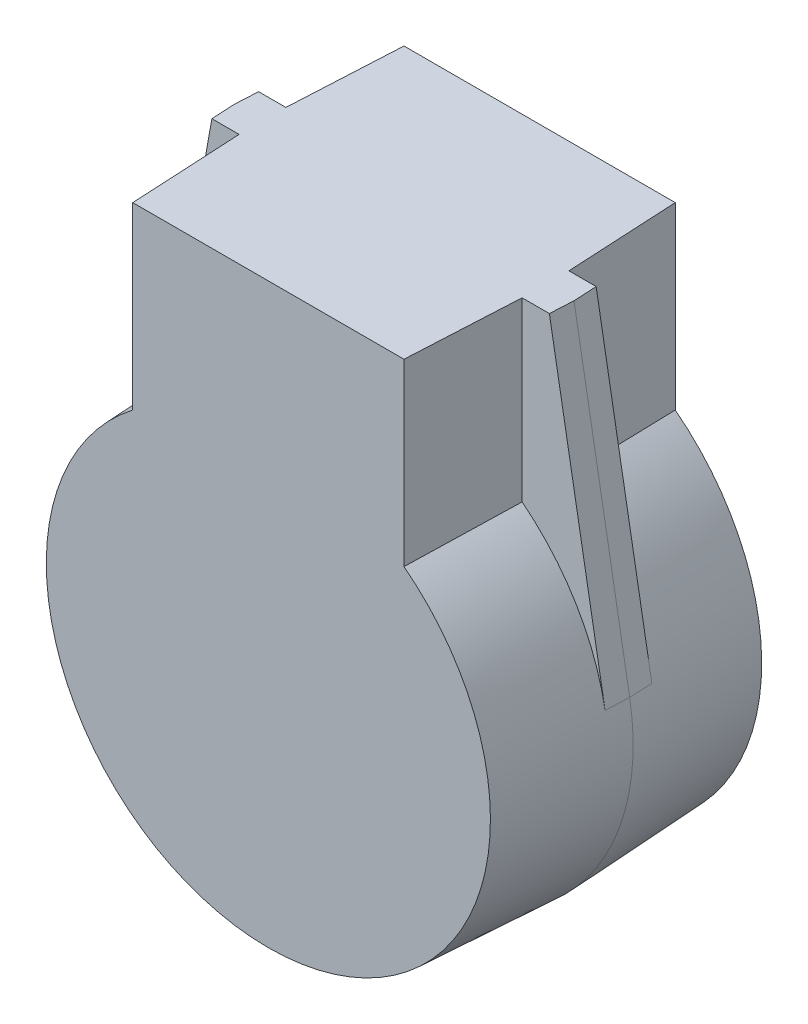
ISO-10303-21;
HEADER;
FILE_DESCRIPTION(('STEP AP214'),'2;1');
FILE_NAME('part.step','',(''),(''),'','','');
FILE_SCHEMA(('AUTOMOTIVE_DESIGN { 1 0 10303 214 1 1 1 1 }'));
ENDSEC;
DATA;
#1=APPLICATION_CONTEXT('core data for automotive mechanical design processes');
#2=APPLICATION_PROTOCOL_DEFINITION('international standard','automotive_design',2000,#1);
#3=PRODUCT_CONTEXT('',#1,'mechanical');
#4=PRODUCT('Part','Part','',(#3));
#5=PRODUCT_RELATED_PRODUCT_CATEGORY('part','',(#4));
#6=PRODUCT_DEFINITION_FORMATION('','',#4);
#7=PRODUCT_DEFINITION_CONTEXT('part definition',#1,'design');
#8=PRODUCT_DEFINITION('design','',#6,#7);
#9=PRODUCT_DEFINITION_SHAPE('','',#8);
#10=(LENGTH_UNIT() NAMED_UNIT(*) SI_UNIT(.MILLI.,.METRE.));
#11=(NAMED_UNIT(*) PLANE_ANGLE_UNIT() SI_UNIT($,.RADIAN.));
#12=(NAMED_UNIT(*) SI_UNIT($,.STERADIAN.) SOLID_ANGLE_UNIT());
#13=UNCERTAINTY_MEASURE_WITH_UNIT(LENGTH_MEASURE(1.E-05),#10,'distance_accuracy_value','');
#14=(GEOMETRIC_REPRESENTATION_CONTEXT(3) GLOBAL_UNCERTAINTY_ASSIGNED_CONTEXT((#13)) GLOBAL_UNIT_ASSIGNED_CONTEXT((#10,
#11,#12)) REPRESENTATION_CONTEXT('',''));
#15=CARTESIAN_POINT('',(0.,0.,0.));
#16=DIRECTION('',(0.,0.,1.));
#17=DIRECTION('',(1.,0.,0.));
#18=AXIS2_PLACEMENT_3D('',#15,#16,#17);
#19=CARTESIAN_POINT('',(-36.35,76.,-29.));
#20=DIRECTION('',(0.,-1.,0.));
#21=DIRECTION('',(1.,0.,0.));
#22=AXIS2_PLACEMENT_3D('',#19,#20,#21);
#23=PLANE('',#22);
#24=DIRECTION('',(-1.,0.,0.));
#25=VECTOR('',#24,1.);
#26=CARTESIAN_POINT('',(-36.35,76.,29.));
#27=LINE('',#26,#25);
#28=CARTESIAN_POINT('',(29.,76.,29.));
#29=VERTEX_POINT('',#28);
#30=CARTESIAN_POINT('',(-29.,76.,29.));
#31=VERTEX_POINT('',#30);
#32=EDGE_CURVE('E114',#29,#31,#27,.T.);
#33=ORIENTED_EDGE('',*,*,#32,.F.);
#34=DIRECTION('',(-0.0523359562429445,0.,0.998629534754574));
#35=VECTOR('',#34,1.);
#36=CARTESIAN_POINT('',(30.257786702793,76.,5.));
#37=LINE('',#36,#35);
#38=CARTESIAN_POINT('',(30.257786702793,76.,5.));
#39=VERTEX_POINT('',#38);
#40=EDGE_CURVE('E135',#39,#29,#37,.T.);
#41=ORIENTED_EDGE('',*,*,#40,.F.);
#42=DIRECTION('',(1.,0.,0.));
#43=VECTOR('',#42,1.);
#44=CARTESIAN_POINT('',(-36.35,76.,5.));
#45=LINE('',#44,#43);
#46=CARTESIAN_POINT('',(36.0839153234149,76.,5.));
#47=VERTEX_POINT('',#46);
#48=EDGE_CURVE('E286',#39,#47,#45,.T.);
#49=ORIENTED_EDGE('',*,*,#48,.T.);
#50=DIRECTION('',(-0.0531417386978423,0.,0.998586979490605));
#51=VECTOR('',#50,1.);
#52=CARTESIAN_POINT('',(37.6836247743269,76.,-25.0601573789613));
#53=LINE('',#52,#51);
#54=CARTESIAN_POINT('',(36.3500000000031,76.,1.17569148860852E-10));
#55=VERTEX_POINT('',#54);
#56=EDGE_CURVE('E249',#55,#47,#53,.T.);
#57=ORIENTED_EDGE('',*,*,#56,.F.);
#58=DIRECTION('',(-0.0531417386974387,0.,-0.998586979490627));
#59=VECTOR('',#58,1.);
#60=CARTESIAN_POINT('',(34.6057591711221,76.,-32.776048046284));
#61=LINE('',#60,#59);
#62=CARTESIAN_POINT('',(36.0839153234044,76.,-5.));
#63=VERTEX_POINT('',#62);
#64=EDGE_CURVE('E248',#55,#63,#61,.T.);
#65=ORIENTED_EDGE('',*,*,#64,.T.);
#66=DIRECTION('',(-1.,0.,0.));
#67=VECTOR('',#66,1.);
#68=CARTESIAN_POINT('',(-36.35,76.,-5.));
#69=LINE('',#68,#67);
#70=CARTESIAN_POINT('',(30.257786702793,76.,-5.));
#71=VERTEX_POINT('',#70);
#72=EDGE_CURVE('E274',#63,#71,#69,.T.);
#73=ORIENTED_EDGE('',*,*,#72,.T.);
#74=DIRECTION('',(0.0523359562429445,0.,0.998629534754574));
#75=VECTOR('',#74,1.);
#76=CARTESIAN_POINT('',(30.257786702793,76.,-5.));
#77=LINE('',#76,#75);
#78=CARTESIAN_POINT('',(29.,76.,-29.));
#79=VERTEX_POINT('',#78);
#80=EDGE_CURVE('E271',#79,#71,#77,.T.);
#81=ORIENTED_EDGE('',*,*,#80,.F.);
#82=DIRECTION('',(1.,0.,0.));
#83=VECTOR('',#82,1.);
#84=CARTESIAN_POINT('',(29.,76.,-29.));
#85=LINE('',#84,#83);
#86=CARTESIAN_POINT('',(-29.,76.,-29.));
#87=VERTEX_POINT('',#86);
#88=EDGE_CURVE('E321',#87,#79,#85,.T.);
#89=ORIENTED_EDGE('',*,*,#88,.F.);
#90=DIRECTION('',(0.0523359562429446,0.,-0.998629534754574));
#91=VECTOR('',#90,1.);
#92=CARTESIAN_POINT('',(-29.,76.,-29.));
#93=LINE('',#92,#91);
#94=CARTESIAN_POINT('',(-30.257786702793,76.,-5.));
#95=VERTEX_POINT('',#94);
#96=EDGE_CURVE('E317',#95,#87,#93,.T.);
#97=ORIENTED_EDGE('',*,*,#96,.F.);
#98=CARTESIAN_POINT('',(-36.083915323408,76.,-5.));
#99=VERTEX_POINT('',#98);
#100=EDGE_CURVE('E277',#95,#99,#69,.T.);
#101=ORIENTED_EDGE('',*,*,#100,.T.);
#102=DIRECTION('',(0.0531417386975882,0.,-0.998586979490619));
#103=VECTOR('',#102,1.);
#104=CARTESIAN_POINT('',(-34.811067198405,76.,-28.9181027126378));
#105=LINE('',#104,#103);
#106=CARTESIAN_POINT('',(-36.3499999999989,76.,-4.44332071136699E-11));
#107=VERTEX_POINT('',#106);
#108=EDGE_CURVE('E293',#107,#99,#105,.T.);
#109=ORIENTED_EDGE('',*,*,#108,.F.);
#110=DIRECTION('',(0.053141738697429,0.,0.998586979490627));
#111=VECTOR('',#110,1.);
#112=CARTESIAN_POINT('',(-37.8889328015881,76.,-28.9181027126384));
#113=LINE('',#112,#111);
#114=CARTESIAN_POINT('',(-36.083915323404,76.,5.));
#115=VERTEX_POINT('',#114);
#116=EDGE_CURVE('E291',#107,#115,#113,.T.);
#117=ORIENTED_EDGE('',*,*,#116,.T.);
#118=CARTESIAN_POINT('',(-30.257786702793,76.,5.));
#119=VERTEX_POINT('',#118);
#120=EDGE_CURVE('E133',#115,#119,#45,.T.);
#121=ORIENTED_EDGE('',*,*,#120,.T.);
#122=DIRECTION('',(-0.0523359562429445,0.,-0.998629534754574));
#123=VECTOR('',#122,1.);
#124=CARTESIAN_POINT('',(-28.8951844414339,76.,31.));
#125=LINE('',#124,#123);
#126=EDGE_CURVE('E128',#31,#119,#125,.T.);
#127=ORIENTED_EDGE('',*,*,#126,.F.);
#128=EDGE_LOOP('',(#33,#41,#49,#57,#65,#73,#81,#89,#97,#101,#109,#117,#121,#127));
#129=FACE_BOUND('',#128,.T.);
#130=ADVANCED_FACE('F17',(#129),#23,.F.);
#131=CARTESIAN_POINT('',(0.,0.,31.));
#132=DIRECTION('',(0.,0.,-1.));
#133=DIRECTION('',(-1.,0.,0.));
#134=AXIS2_PLACEMENT_3D('',#131,#132,#133);
#135=CONICAL_SURFACE('',#134,47.3753588422257,0.05235987755983);
#136=CARTESIAN_POINT('',(0.,0.,29.));
#137=DIRECTION('',(0.,0.,1.));
#138=DIRECTION('',(1.,0.,0.));
#139=AXIS2_PLACEMENT_3D('',#136,#137,#138);
#140=CIRCLE('',#139,47.4801744007918);
#141=CARTESIAN_POINT('',(-29.,37.5947730559663,29.));
#142=VERTEX_POINT('',#141);
#143=CARTESIAN_POINT('',(29.,37.5947730559663,29.));
#144=VERTEX_POINT('',#143);
#145=EDGE_CURVE('E122',#142,#144,#140,.T.);
#146=ORIENTED_EDGE('',*,*,#145,.F.);
#147=CARTESIAN_POINT('',(-30.2577971843489,38.2080565298052,4.9998));
#148=CARTESIAN_POINT('',(-30.0306920147977,38.0982205120841,9.33322478269607));
#149=CARTESIAN_POINT('',(-29.8035874946697,37.9878985558515,13.6666371736589));
#150=CARTESIAN_POINT('',(-29.3493797531794,37.7662827663239,22.3334371736589));
#151=CARTESIAN_POINT('',(-29.1222765318171,37.6549889330285,26.6668247826961));
#152=CARTESIAN_POINT('',(-28.8951739598781,37.5432091612213,31.0002));
#153=B_SPLINE_CURVE_WITH_KNOTS('',3,(#147,#148,#149,#150,#151,#152),.UNSPECIFIED.,.F.,.F.,(4,2,
4),(0.,13.0222844818087,26.044568968248),.UNSPECIFIED.);
#154=CARTESIAN_POINT('',(-30.257786702793,38.2080514601678,5.));
#155=VERTEX_POINT('',#154);
#156=EDGE_CURVE('E130',#155,#142,#153,.T.);
#157=ORIENTED_EDGE('',*,*,#156,.F.);
#158=CARTESIAN_POINT('',(0.,0.,5.));
#159=DIRECTION('',(0.,0.,-1.));
#160=DIRECTION('',(-1.,0.,0.));
#161=AXIS2_PLACEMENT_3D('',#158,#159,#160);
#162=CIRCLE('',#161,48.7379611035848);
#163=CARTESIAN_POINT('',(-47.9969072425958,8.46674362904152,5.));
#164=VERTEX_POINT('',#163);
#165=EDGE_CURVE('E307',#164,#155,#162,.T.);
#166=ORIENTED_EDGE('',*,*,#165,.F.);
#167=DIRECTION('',(0.0515401953706374,-0.00909178623923142,0.998629534754574));
#168=VECTOR('',#167,1.);
#169=CARTESIAN_POINT('',(0.,0.,934.975697698679));
#170=LINE('',#169,#168);
#171=CARTESIAN_POINT('',(-48.254961874355,8.51226494562028,-4.44332071136699E-11));
#172=VERTEX_POINT('',#171);
#173=EDGE_CURVE('E234',#172,#164,#170,.T.);
#174=ORIENTED_EDGE('',*,*,#173,.F.);
#175=CARTESIAN_POINT('',(0.,0.,0.));
#176=DIRECTION('',(0.,0.,-1.));
#177=DIRECTION('',(-1.,0.,0.));
#178=AXIS2_PLACEMENT_3D('',#175,#176,#177);
#179=CIRCLE('',#178,49.);
#180=CARTESIAN_POINT('',(48.2549618743591,8.51226494562099,1.17569148860852E-10));
#181=VERTEX_POINT('',#180);
#182=EDGE_CURVE('E246',#181,#172,#179,.T.);
#183=ORIENTED_EDGE('',*,*,#182,.F.);
#184=DIRECTION('',(0.0515401953706374,0.0090917862392314,-0.998629534754574));
#185=VECTOR('',#184,1.);
#186=CARTESIAN_POINT('',(0.,0.,934.975697698679));
#187=LINE('',#186,#185);
#188=CARTESIAN_POINT('',(47.9969072426063,8.46674362904335,5.));
#189=VERTEX_POINT('',#188);
#190=EDGE_CURVE('E233',#189,#181,#187,.T.);
#191=ORIENTED_EDGE('',*,*,#190,.F.);
#192=CARTESIAN_POINT('',(30.257786702793,38.2080514601678,5.));
#193=VERTEX_POINT('',#192);
#194=EDGE_CURVE('E646',#193,#189,#162,.T.);
#195=ORIENTED_EDGE('',*,*,#194,.F.);
#196=CARTESIAN_POINT('',(28.8951739598781,37.5432091612213,31.0002));
#197=CARTESIAN_POINT('',(29.1222765318171,37.6549889330285,26.6668247826961));
#198=CARTESIAN_POINT('',(29.3493797531794,37.7662827663239,22.3334371736589));
#199=CARTESIAN_POINT('',(29.8035874946697,37.9878985558515,13.6666371736589));
#200=CARTESIAN_POINT('',(30.0306920147977,38.0982205120841,9.33322478269607));
#201=CARTESIAN_POINT('',(30.2577971843489,38.2080565298051,4.9998));
#202=B_SPLINE_CURVE_WITH_KNOTS('',3,(#196,#197,#198,#199,#200,#201),.UNSPECIFIED.,.F.,.F.,(4,2,
4),(0.,13.0222844864393,26.044568968248),.UNSPECIFIED.);
#203=EDGE_CURVE('E140',#144,#193,#202,.T.);
#204=ORIENTED_EDGE('',*,*,#203,.F.);
#205=EDGE_LOOP('',(#146,#157,#166,#174,#183,#191,#195,#204));
#206=FACE_BOUND('',#205,.T.);
#207=ADVANCED_FACE('F170',(#206),#135,.T.);
#208=CARTESIAN_POINT('',(30.2577867027931,-93.7910480561332,5.));
#209=DIRECTION('',(-0.998629534754574,0.,-0.0523359562429445));
#210=DIRECTION('',(-0.0523359562429445,0.,0.998629534754574));
#211=AXIS2_PLACEMENT_3D('',#208,#209,#210);
#212=PLANE('',#211);
#213=DIRECTION('',(0.,1.,0.));
#214=VECTOR('',#213,1.);
#215=CARTESIAN_POINT('',(29.,-93.7910480561332,29.));
#216=LINE('',#215,#214);
#217=EDGE_CURVE('E32',#144,#29,#216,.T.);
#218=ORIENTED_EDGE('',*,*,#217,.F.);
#219=ORIENTED_EDGE('',*,*,#203,.T.);
#220=DIRECTION('',(0.,1.,0.));
#221=VECTOR('',#220,1.);
#222=CARTESIAN_POINT('',(30.2577867027931,-48.7379611035848,5.));
#223=LINE('',#222,#221);
#224=EDGE_CURVE('E261',#193,#39,#223,.T.);
#225=ORIENTED_EDGE('',*,*,#224,.T.);
#226=ORIENTED_EDGE('',*,*,#40,.T.);
#227=EDGE_LOOP('',(#218,#219,#225,#226));
#228=FACE_BOUND('',#227,.T.);
#229=ADVANCED_FACE('F165',(#228),#212,.F.);
#230=CARTESIAN_POINT('',(-28.8951844414339,-93.7910480561332,31.));
#231=DIRECTION('',(0.998629534754574,0.,-0.0523359562429445));
#232=DIRECTION('',(-0.0523359562429445,0.,-0.998629534754574));
#233=AXIS2_PLACEMENT_3D('',#230,#231,#232);
#234=PLANE('',#233);
#235=DIRECTION('',(0.,-1.,0.));
#236=VECTOR('',#235,1.);
#237=CARTESIAN_POINT('',(-29.,-93.7910480561332,29.));
#238=LINE('',#237,#236);
#239=EDGE_CURVE('E11',#31,#142,#238,.T.);
#240=ORIENTED_EDGE('',*,*,#239,.F.);
#241=ORIENTED_EDGE('',*,*,#126,.T.);
#242=DIRECTION('',(0.,-1.,0.));
#243=VECTOR('',#242,1.);
#244=CARTESIAN_POINT('',(-30.257786702793,-48.7379611035848,5.));
#245=LINE('',#244,#243);
#246=EDGE_CURVE('E259',#119,#155,#245,.T.);
#247=ORIENTED_EDGE('',*,*,#246,.T.);
#248=ORIENTED_EDGE('',*,*,#156,.T.);
#249=EDGE_LOOP('',(#240,#241,#247,#248));
#250=FACE_BOUND('',#249,.T.);
#251=ADVANCED_FACE('F126',(#250),#234,.F.);
#252=CARTESIAN_POINT('',(0.,-150.,-5.));
#253=DIRECTION('',(0.,0.,1.));
#254=DIRECTION('',(1.,0.,0.));
#255=AXIS2_PLACEMENT_3D('',#252,#253,#254);
#256=PLANE('',#255);
#257=DIRECTION('',(0.,-1.,0.));
#258=VECTOR('',#257,1.);
#259=CARTESIAN_POINT('',(30.2577867027931,-150.,-5.));
#260=LINE('',#259,#258);
#261=CARTESIAN_POINT('',(30.257786702793,38.2080514601678,-5.));
#262=VERTEX_POINT('',#261);
#263=EDGE_CURVE('E25',#71,#262,#260,.T.);
#264=ORIENTED_EDGE('',*,*,#263,.F.);
#265=ORIENTED_EDGE('',*,*,#72,.F.);
#266=DIRECTION('',(-0.173719692767764,0.984795140292982,0.));
#267=VECTOR('',#266,1.);
#268=CARTESIAN_POINT('',(18.500858539568,175.676142619973,-5.));
#269=LINE('',#268,#267);
#270=CARTESIAN_POINT('',(47.9969072425962,8.46674362904156,-5.));
#271=VERTEX_POINT('',#270);
#272=EDGE_CURVE('E226',#271,#63,#269,.T.);
#273=ORIENTED_EDGE('',*,*,#272,.F.);
#274=CARTESIAN_POINT('',(0.,0.,-5.));
#275=DIRECTION('',(0.,0.,-1.));
#276=DIRECTION('',(-1.,0.,0.));
#277=AXIS2_PLACEMENT_3D('',#274,#275,#276);
#278=CIRCLE('',#277,48.7379611035848);
#279=EDGE_CURVE('E275',#262,#271,#278,.T.);
#280=ORIENTED_EDGE('',*,*,#279,.F.);
#281=EDGE_LOOP('',(#264,#265,#273,#280));
#282=FACE_BOUND('',#281,.T.);
#283=ADVANCED_FACE('F164',(#282),#256,.F.);
#284=DIRECTION('',(0.,1.,0.));
#285=VECTOR('',#284,1.);
#286=CARTESIAN_POINT('',(-30.257786702793,-150.,-5.));
#287=LINE('',#286,#285);
#288=CARTESIAN_POINT('',(-30.257786702793,38.2080514601678,-5.));
#289=VERTEX_POINT('',#288);
#290=EDGE_CURVE('E264',#289,#95,#287,.T.);
#291=ORIENTED_EDGE('',*,*,#290,.F.);
#292=CARTESIAN_POINT('',(-47.9969072425996,8.46674362904219,-5.));
#293=VERTEX_POINT('',#292);
#294=EDGE_CURVE('E284',#293,#289,#278,.T.);
#295=ORIENTED_EDGE('',*,*,#294,.F.);
#296=DIRECTION('',(0.173719692767765,0.984795140292982,0.));
#297=VECTOR('',#296,1.);
#298=CARTESIAN_POINT('',(-18.5008585395714,175.676142619974,-5.));
#299=LINE('',#298,#297);
#300=EDGE_CURVE('E256',#293,#99,#299,.T.);
#301=ORIENTED_EDGE('',*,*,#300,.T.);
#302=ORIENTED_EDGE('',*,*,#100,.F.);
#303=EDGE_LOOP('',(#291,#295,#301,#302));
#304=FACE_BOUND('',#303,.T.);
#305=ADVANCED_FACE('F198',(#304),#256,.F.);
#306=CARTESIAN_POINT('',(0.,-48.7379611035848,5.));
#307=DIRECTION('',(0.,0.,-1.));
#308=DIRECTION('',(-1.,0.,0.));
#309=AXIS2_PLACEMENT_3D('',#306,#307,#308);
#310=PLANE('',#309);
#311=ORIENTED_EDGE('',*,*,#224,.F.);
#312=ORIENTED_EDGE('',*,*,#194,.T.);
#313=DIRECTION('',(-0.173719692767764,0.984795140292982,0.));
#314=VECTOR('',#313,1.);
#315=CARTESIAN_POINT('',(18.5008585395782,175.676142619975,5.));
#316=LINE('',#315,#314);
#317=EDGE_CURVE('E281',#189,#47,#316,.T.);
#318=ORIENTED_EDGE('',*,*,#317,.T.);
#319=ORIENTED_EDGE('',*,*,#48,.F.);
#320=EDGE_LOOP('',(#311,#312,#318,#319));
#321=FACE_BOUND('',#320,.T.);
#322=ADVANCED_FACE('F193',(#321),#310,.F.);
#323=ORIENTED_EDGE('',*,*,#246,.F.);
#324=ORIENTED_EDGE('',*,*,#120,.F.);
#325=DIRECTION('',(0.173719692767765,0.984795140292982,0.));
#326=VECTOR('',#325,1.);
#327=CARTESIAN_POINT('',(-18.5008585395676,175.676142619973,5.));
#328=LINE('',#327,#326);
#329=EDGE_CURVE('E252',#164,#115,#328,.T.);
#330=ORIENTED_EDGE('',*,*,#329,.F.);
#331=ORIENTED_EDGE('',*,*,#165,.T.);
#332=EDGE_LOOP('',(#323,#324,#330,#331));
#333=FACE_BOUND('',#332,.T.);
#334=ADVANCED_FACE('F187',(#333),#310,.F.);
#335=CARTESIAN_POINT('',(-47.4801744007918,0.,-29.));
#336=DIRECTION('',(0.,0.,1.));
#337=DIRECTION('',(1.,0.,0.));
#338=AXIS2_PLACEMENT_3D('',#335,#336,#337);
#339=PLANE('',#338);
#340=CARTESIAN_POINT('',(0.,0.,-29.));
#341=DIRECTION('',(0.,0.,-1.));
#342=DIRECTION('',(-1.,0.,0.));
#343=AXIS2_PLACEMENT_3D('',#340,#341,#342);
#344=CIRCLE('',#343,47.4801744007918);
#345=CARTESIAN_POINT('',(29.,37.5947730559662,-29.));
#346=VERTEX_POINT('',#345);
#347=CARTESIAN_POINT('',(-29.,37.5947730559663,-29.));
#348=VERTEX_POINT('',#347);
#349=EDGE_CURVE('E40',#346,#348,#344,.T.);
#350=ORIENTED_EDGE('',*,*,#349,.T.);
#351=DIRECTION('',(0.,1.,0.));
#352=VECTOR('',#351,1.);
#353=CARTESIAN_POINT('',(-29.,-93.7910480561332,-29.));
#354=LINE('',#353,#352);
#355=EDGE_CURVE('E312',#348,#87,#354,.T.);
#356=ORIENTED_EDGE('',*,*,#355,.T.);
#357=ORIENTED_EDGE('',*,*,#88,.T.);
#358=DIRECTION('',(0.,1.,0.));
#359=VECTOR('',#358,1.);
#360=CARTESIAN_POINT('',(29.,-93.7910480561332,-29.));
#361=LINE('',#360,#359);
#362=EDGE_CURVE('E319',#346,#79,#361,.T.);
#363=ORIENTED_EDGE('',*,*,#362,.F.);
#364=EDGE_LOOP('',(#350,#356,#357,#363));
#365=FACE_BOUND('',#364,.T.);
#366=ADVANCED_FACE('F185',(#365),#339,.F.);
#367=CARTESIAN_POINT('',(0.,0.,0.));
#368=DIRECTION('',(0.,0.,1.));
#369=DIRECTION('',(1.,0.,0.));
#370=AXIS2_PLACEMENT_3D('',#367,#368,#369);
#371=CONICAL_SURFACE('',#370,49.,0.0523598775598305);
#372=CARTESIAN_POINT('',(-28.9999895184441,37.5947679036278,-29.0002));
#373=CARTESIAN_POINT('',(-29.209623025749,37.6978090995318,-25.0001543927889));
#374=CARTESIAN_POINT('',(-29.419257084908,37.8004370830057,-21.0000982555718));
#375=CARTESIAN_POINT('',(-29.8385263068763,38.0048666250646,-12.9999649222385));
#376=CARTESIAN_POINT('',(-30.0481614696855,38.1066681836499,-8.99988772612226));
#377=CARTESIAN_POINT('',(-30.2577971843489,38.2080565298052,-4.9998));
#378=B_SPLINE_CURVE_WITH_KNOTS('',3,(#372,#373,#374,#375,#376,#377),.UNSPECIFIED.,.F.,.F.,(4,2,
4),(0.,12.0205803680087,24.0411607326729),.UNSPECIFIED.);
#379=EDGE_CURVE('E309',#348,#289,#378,.T.);
#380=ORIENTED_EDGE('',*,*,#379,.F.);
#381=ORIENTED_EDGE('',*,*,#349,.F.);
#382=CARTESIAN_POINT('',(30.2577971843489,38.2080565298051,-4.9998));
#383=CARTESIAN_POINT('',(30.0481614696854,38.1066681836499,-8.99988772612226));
#384=CARTESIAN_POINT('',(29.8385263068763,38.0048666250646,-12.9999649222385));
#385=CARTESIAN_POINT('',(29.419257084908,37.8004370830057,-21.0000982555718));
#386=CARTESIAN_POINT('',(29.209623025749,37.6978090995319,-25.0001543927889));
#387=CARTESIAN_POINT('',(28.9999895184441,37.5947679036278,-29.0002));
#388=B_SPLINE_CURVE_WITH_KNOTS('',3,(#382,#383,#384,#385,#386,#387),.UNSPECIFIED.,.F.,.F.,(4,2,
4),(0.,12.0205803646641,24.0411607326729),.UNSPECIFIED.);
#389=EDGE_CURVE('E143',#262,#346,#388,.T.);
#390=ORIENTED_EDGE('',*,*,#389,.F.);
#391=ORIENTED_EDGE('',*,*,#279,.T.);
#392=DIRECTION('',(-0.0515401953706378,-0.00909178623923148,-0.998629534754574));
#393=VECTOR('',#392,1.);
#394=CARTESIAN_POINT('',(0.,0.,-934.975697698671));
#395=LINE('',#394,#393);
#396=EDGE_CURVE('E223',#181,#271,#395,.T.);
#397=ORIENTED_EDGE('',*,*,#396,.F.);
#398=ORIENTED_EDGE('',*,*,#182,.T.);
#399=DIRECTION('',(-0.0515401953706378,0.00909178623923149,0.998629534754574));
#400=VECTOR('',#399,1.);
#401=CARTESIAN_POINT('',(0.,0.,-934.975697698671));
#402=LINE('',#401,#400);
#403=EDGE_CURVE('E241',#293,#172,#402,.T.);
#404=ORIENTED_EDGE('',*,*,#403,.F.);
#405=ORIENTED_EDGE('',*,*,#294,.T.);
#406=EDGE_LOOP('',(#380,#381,#390,#391,#397,#398,#404,#405));
#407=FACE_BOUND('',#406,.T.);
#408=ADVANCED_FACE('F19',(#407),#371,.T.);
#409=CARTESIAN_POINT('',(17.2345195982099,175.452758077512,29.536256775106));
#410=DIRECTION('',(0.983445512779331,0.173481615966377,0.0523359562432352));
#411=DIRECTION('',(-0.173719692767764,0.984795140292982,0.));
#412=AXIS2_PLACEMENT_3D('',#409,#410,#411);
#413=PLANE('',#412);
#414=ORIENTED_EDGE('',*,*,#317,.F.);
#415=ORIENTED_EDGE('',*,*,#190,.T.);
#416=DIRECTION('',(0.173719692767764,-0.984795140292982,0.));
#417=VECTOR('',#416,1.);
#418=CARTESIAN_POINT('',(18.758913171331,175.721663936552,1.17569148860852E-10));
#419=LINE('',#418,#417);
#420=EDGE_CURVE('E229',#55,#181,#419,.T.);
#421=ORIENTED_EDGE('',*,*,#420,.F.);
#422=ORIENTED_EDGE('',*,*,#56,.T.);
#423=EDGE_LOOP('',(#414,#415,#421,#422));
#424=FACE_BOUND('',#423,.T.);
#425=ADVANCED_FACE('F183',(#424),#413,.T.);
#426=CARTESIAN_POINT('',(18.758913171331,175.721663936552,1.17569148860852E-10));
#427=DIRECTION('',(-0.983445512779351,-0.173481615966381,0.0523359562428377));
#428=DIRECTION('',(0.173719692767764,-0.984795140292982,0.));
#429=AXIS2_PLACEMENT_3D('',#426,#427,#428);
#430=PLANE('',#429);
#431=ORIENTED_EDGE('',*,*,#396,.T.);
#432=ORIENTED_EDGE('',*,*,#272,.T.);
#433=ORIENTED_EDGE('',*,*,#64,.F.);
#434=ORIENTED_EDGE('',*,*,#420,.T.);
#435=EDGE_LOOP('',(#431,#432,#433,#434));
#436=FACE_BOUND('',#435,.T.);
#437=ADVANCED_FACE('F211',(#436),#430,.F.);
#438=CARTESIAN_POINT('',(-17.2635642242242,175.457881603514,-28.9734955912209));
#439=DIRECTION('',(-0.983445512779344,0.17348161596638,-0.052335956242985));
#440=DIRECTION('',(-0.173719692767765,-0.984795140292982,0.));
#441=AXIS2_PLACEMENT_3D('',#438,#439,#440);
#442=PLANE('',#441);
#443=ORIENTED_EDGE('',*,*,#300,.F.);
#444=ORIENTED_EDGE('',*,*,#403,.T.);
#445=DIRECTION('',(-0.173719692767765,-0.984795140292982,0.));
#446=VECTOR('',#445,1.);
#447=CARTESIAN_POINT('',(-18.7589131713267,175.721663936552,-4.44332071136699E-11));
#448=LINE('',#447,#446);
#449=EDGE_CURVE('E279',#107,#172,#448,.T.);
#450=ORIENTED_EDGE('',*,*,#449,.F.);
#451=ORIENTED_EDGE('',*,*,#108,.T.);
#452=EDGE_LOOP('',(#443,#444,#450,#451));
#453=FACE_BOUND('',#452,.T.);
#454=ADVANCED_FACE('F208',(#453),#442,.T.);
#455=CARTESIAN_POINT('',(-18.7589131713267,175.721663936552,-4.44349418371459E-11));
#456=DIRECTION('',(0.983445512779352,-0.173481615966382,-0.0523359562428281));
#457=DIRECTION('',(0.173719692767765,0.984795140292982,0.));
#458=AXIS2_PLACEMENT_3D('',#455,#456,#457);
#459=PLANE('',#458);
#460=ORIENTED_EDGE('',*,*,#173,.T.);
#461=ORIENTED_EDGE('',*,*,#329,.T.);
#462=ORIENTED_EDGE('',*,*,#116,.F.);
#463=ORIENTED_EDGE('',*,*,#449,.T.);
#464=EDGE_LOOP('',(#460,#461,#462,#463));
#465=FACE_BOUND('',#464,.T.);
#466=ADVANCED_FACE('F204',(#465),#459,.F.);
#467=CARTESIAN_POINT('',(30.2577867027931,-93.7910480561332,-5.));
#468=DIRECTION('',(-0.998629534754574,0.,0.0523359562429445));
#469=DIRECTION('',(0.0523359562429445,0.,0.998629534754574));
#470=AXIS2_PLACEMENT_3D('',#467,#468,#469);
#471=PLANE('',#470);
#472=ORIENTED_EDGE('',*,*,#263,.T.);
#473=ORIENTED_EDGE('',*,*,#389,.T.);
#474=ORIENTED_EDGE('',*,*,#362,.T.);
#475=ORIENTED_EDGE('',*,*,#80,.T.);
#476=EDGE_LOOP('',(#472,#473,#474,#475));
#477=FACE_BOUND('',#476,.T.);
#478=ADVANCED_FACE('F207',(#477),#471,.F.);
#479=CARTESIAN_POINT('',(-29.,-93.7910480561332,-29.));
#480=DIRECTION('',(0.998629534754574,0.,0.0523359562429446));
#481=DIRECTION('',(0.0523359562429446,0.,-0.998629534754574));
#482=AXIS2_PLACEMENT_3D('',#479,#480,#481);
#483=PLANE('',#482);
#484=ORIENTED_EDGE('',*,*,#355,.F.);
#485=ORIENTED_EDGE('',*,*,#379,.T.);
#486=ORIENTED_EDGE('',*,*,#290,.T.);
#487=ORIENTED_EDGE('',*,*,#96,.T.);
#488=EDGE_LOOP('',(#484,#485,#486,#487));
#489=FACE_BOUND('',#488,.T.);
#490=ADVANCED_FACE('F315',(#489),#483,.F.);
#491=CARTESIAN_POINT('',(-65.7425164897352,81.8333411979233,29.));
#492=DIRECTION('',(0.,0.,1.));
#493=DIRECTION('',(1.,0.,0.));
#494=AXIS2_PLACEMENT_3D('',#491,#492,#493);
#495=PLANE('',#494);
#496=ORIENTED_EDGE('',*,*,#217,.T.);
#497=ORIENTED_EDGE('',*,*,#32,.T.);
#498=ORIENTED_EDGE('',*,*,#239,.T.);
#499=ORIENTED_EDGE('',*,*,#145,.T.);
#500=EDGE_LOOP('',(#496,#497,#498,#499));
#501=FACE_BOUND('',#500,.T.);
#502=ADVANCED_FACE('F116',(#501),#495,.T.);
#503=CLOSED_SHELL('',(#130,#207,#229,#251,#283,#305,#322,#334,#366,#408,#425,#437,#454,#466,
#478,#490,#502));
#504=MANIFOLD_SOLID_BREP('B1',#503);
#505=ADVANCED_BREP_SHAPE_REPRESENTATION('',(#18,#504),#14);
#506=SHAPE_DEFINITION_REPRESENTATION(#9,#505);
ENDSEC;
END-ISO-10303-21;
